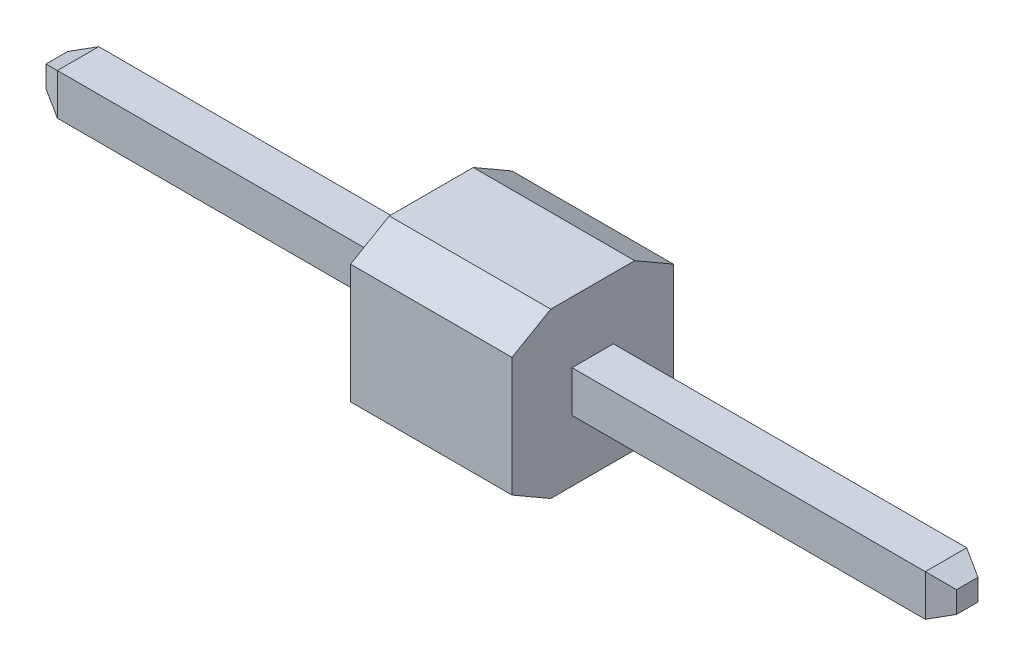
ISO-10303-21;
HEADER;
FILE_DESCRIPTION(('STEP AP214'),'2;1');
FILE_NAME('part.step','',(''),(''),'','','');
FILE_SCHEMA(('AUTOMOTIVE_DESIGN { 1 0 10303 214 1 1 1 1 }'));
ENDSEC;
DATA;
#1=APPLICATION_CONTEXT('core data for automotive mechanical design processes');
#2=APPLICATION_PROTOCOL_DEFINITION('international standard','automotive_design',2000,#1);
#3=PRODUCT_CONTEXT('',#1,'mechanical');
#4=PRODUCT('Part','Part','',(#3));
#5=PRODUCT_RELATED_PRODUCT_CATEGORY('part','',(#4));
#6=PRODUCT_DEFINITION_FORMATION('','',#4);
#7=PRODUCT_DEFINITION_CONTEXT('part definition',#1,'design');
#8=PRODUCT_DEFINITION('design','',#6,#7);
#9=PRODUCT_DEFINITION_SHAPE('','',#8);
#10=(LENGTH_UNIT() NAMED_UNIT(*) SI_UNIT(.MILLI.,.METRE.));
#11=(NAMED_UNIT(*) PLANE_ANGLE_UNIT() SI_UNIT($,.RADIAN.));
#12=(NAMED_UNIT(*) SI_UNIT($,.STERADIAN.) SOLID_ANGLE_UNIT());
#13=UNCERTAINTY_MEASURE_WITH_UNIT(LENGTH_MEASURE(1.E-05),#10,'distance_accuracy_value','');
#14=(GEOMETRIC_REPRESENTATION_CONTEXT(3) GLOBAL_UNCERTAINTY_ASSIGNED_CONTEXT((#13)) GLOBAL_UNIT_ASSIGNED_CONTEXT((#10,
#11,#12)) REPRESENTATION_CONTEXT('',''));
#15=CARTESIAN_POINT('',(0.,0.,0.));
#16=DIRECTION('',(0.,0.,1.));
#17=DIRECTION('',(1.,0.,0.));
#18=AXIS2_PLACEMENT_3D('',#15,#16,#17);
#19=CARTESIAN_POINT('',(5.42107550068064,-13.0171215871937,0.629998634255617));
#20=DIRECTION('',(1.,4.37113882867379E-08,-4.37113882867379E-08));
#21=DIRECTION('',(-4.37113882867379E-08,1.,0.));
#22=AXIS2_PLACEMENT_3D('',#19,#20,#21);
#23=PLANE('',#22);
#24=DIRECTION('',(1.59994777304463E-08,0.50000000000019,0.866025403784329));
#25=VECTOR('',#24,1.);
#26=CARTESIAN_POINT('',(5.42107537769472,-11.7735317487037,-0.940001365744382));
#27=LINE('',#26,#25);
#28=CARTESIAN_POINT('',(5.42107537769472,-11.7735317487037,-0.940001365744382));
#29=VERTEX_POINT('',#28);
#30=CARTESIAN_POINT('',(5.42107538877949,-11.4271215871937,-0.340001365744383));
#31=VERTEX_POINT('',#30);
#32=EDGE_CURVE('E11',#29,#31,#27,.T.);
#33=ORIENTED_EDGE('',*,*,#32,.T.);
#34=DIRECTION('',(4.37113880134522E-08,0.,0.999999999999999));
#35=VECTOR('',#34,1.);
#36=CARTESIAN_POINT('',(5.42107538877949,-11.4271215871937,-0.340001365744383));
#37=LINE('',#36,#35);
#38=CARTESIAN_POINT('',(5.42107544560429,-11.4271215871937,0.959998634255618));
#39=VERTEX_POINT('',#38);
#40=EDGE_CURVE('E304',#31,#39,#37,.T.);
#41=ORIENTED_EDGE('',*,*,#40,.T.);
#42=DIRECTION('',(5.97108681645512E-08,-0.500000000000186,0.86602540378433));
#43=VECTOR('',#42,1.);
#44=CARTESIAN_POINT('',(5.42107544560429,-11.4271215871937,0.959998634255618));
#45=LINE('',#44,#43);
#46=CARTESIAN_POINT('',(5.42107548697319,-11.7735317487037,1.55999863425562));
#47=VERTEX_POINT('',#46);
#48=EDGE_CURVE('E296',#39,#47,#45,.T.);
#49=ORIENTED_EDGE('',*,*,#48,.T.);
#50=DIRECTION('',(4.37113884815545E-08,-0.999999999999999,0.));
#51=VECTOR('',#50,1.);
#52=CARTESIAN_POINT('',(5.42107548697319,-11.7735317487037,1.55999863425562));
#53=LINE('',#52,#51);
#54=CARTESIAN_POINT('',(5.42107556771598,-13.6207114256737,1.55999863425562));
#55=VERTEX_POINT('',#54);
#56=EDGE_CURVE('E281',#47,#55,#53,.T.);
#57=ORIENTED_EDGE('',*,*,#56,.T.);
#58=DIRECTION('',(1.59994802942811E-08,0.500000000000195,0.866025403784326));
#59=VECTOR('',#58,1.);
#60=CARTESIAN_POINT('',(5.42107555663122,-13.9671215871937,0.959998634255618));
#61=LINE('',#60,#59);
#62=CARTESIAN_POINT('',(5.42107555663122,-13.9671215871937,0.959998634255618));
#63=VERTEX_POINT('',#62);
#64=EDGE_CURVE('E265',#63,#55,#61,.T.);
#65=ORIENTED_EDGE('',*,*,#64,.F.);
#66=DIRECTION('',(4.37113880134522E-08,0.,0.999999999999999));
#67=VECTOR('',#66,1.);
#68=CARTESIAN_POINT('',(5.42107549980641,-13.9671215871937,-0.340001365744383));
#69=LINE('',#68,#67);
#70=CARTESIAN_POINT('',(5.42107549980641,-13.9671215871937,-0.340001365744383));
#71=VERTEX_POINT('',#70);
#72=EDGE_CURVE('E248',#71,#63,#69,.T.);
#73=ORIENTED_EDGE('',*,*,#72,.F.);
#74=DIRECTION('',(5.97108656001698E-08,-0.50000000000019,0.866025403784327));
#75=VECTOR('',#74,1.);
#76=CARTESIAN_POINT('',(5.42107545843751,-13.6207114256737,-0.940001365744382));
#77=LINE('',#76,#75);
#78=CARTESIAN_POINT('',(5.42107545843751,-13.6207114256737,-0.940001365744382));
#79=VERTEX_POINT('',#78);
#80=EDGE_CURVE('E242',#79,#71,#77,.T.);
#81=ORIENTED_EDGE('',*,*,#80,.F.);
#82=DIRECTION('',(4.37113884815545E-08,-0.999999999999999,0.));
#83=VECTOR('',#82,1.);
#84=CARTESIAN_POINT('',(5.42107537769472,-11.7735317487037,-0.940001365744382));
#85=LINE('',#84,#83);
#86=EDGE_CURVE('E236',#29,#79,#85,.T.);
#87=ORIENTED_EDGE('',*,*,#86,.F.);
#88=EDGE_LOOP('',(#33,#41,#49,#57,#65,#73,#81,#87));
#89=FACE_BOUND('',#88,.T.);
#90=DIRECTION('',(-4.37113872875372E-08,0.,-0.999999999999999));
#91=VECTOR('',#90,1.);
#92=CARTESIAN_POINT('',(5.42107547270535,-12.3771215871937,0.629998634255617));
#93=LINE('',#92,#91);
#94=CARTESIAN_POINT('',(5.42107547270535,-12.3771215871937,0.629998634255617));
#95=VERTEX_POINT('',#94);
#96=CARTESIAN_POINT('',(5.42107544473006,-12.3771215871937,-0.0100013657443826));
#97=VERTEX_POINT('',#96);
#98=EDGE_CURVE('E302',#95,#97,#93,.T.);
#99=ORIENTED_EDGE('',*,*,#98,.T.);
#100=DIRECTION('',(-4.37113872875374E-08,0.999999999999999,0.));
#101=VECTOR('',#100,1.);
#102=CARTESIAN_POINT('',(5.42107547270535,-13.0171215871937,-0.0100013657443826));
#103=LINE('',#102,#101);
#104=CARTESIAN_POINT('',(5.42107547270535,-13.0171215871937,-0.0100013657443826));
#105=VERTEX_POINT('',#104);
#106=EDGE_CURVE('E293',#105,#97,#103,.T.);
#107=ORIENTED_EDGE('',*,*,#106,.F.);
#108=DIRECTION('',(-4.37113886753159E-08,0.,-0.999999999999999));
#109=VECTOR('',#108,1.);
#110=CARTESIAN_POINT('',(5.42107550068064,-13.0171215871937,0.629998634255617));
#111=LINE('',#110,#109);
#112=CARTESIAN_POINT('',(5.42107550068064,-13.0171215871937,0.629998634255617));
#113=VERTEX_POINT('',#112);
#114=EDGE_CURVE('E278',#113,#105,#111,.T.);
#115=ORIENTED_EDGE('',*,*,#114,.F.);
#116=DIRECTION('',(-4.37113886753161E-08,0.999999999999999,0.));
#117=VECTOR('',#116,1.);
#118=CARTESIAN_POINT('',(5.42107550068064,-13.0171215871937,0.629998634255617));
#119=LINE('',#118,#117);
#120=EDGE_CURVE('E263',#113,#95,#119,.T.);
#121=ORIENTED_EDGE('',*,*,#120,.T.);
#122=EDGE_LOOP('',(#99,#107,#115,#121));
#123=FACE_BOUND('',#122,.T.);
#124=ADVANCED_FACE('F17',(#89,#123),#23,.T.);
#125=CARTESIAN_POINT('',(2.92107550068064,-13.0171216964722,0.629998743534088));
#126=DIRECTION('',(1.,4.37113882867379E-08,-4.37113882867379E-08));
#127=DIRECTION('',(-4.37113882867379E-08,1.,0.));
#128=AXIS2_PLACEMENT_3D('',#125,#126,#127);
#129=PLANE('',#128);
#130=DIRECTION('',(1.59994790124215E-08,0.50000000000019,0.866025403784329));
#131=VECTOR('',#130,1.);
#132=CARTESIAN_POINT('',(2.92107537769472,-11.7735318579822,-0.940001256465912));
#133=LINE('',#132,#131);
#134=CARTESIAN_POINT('',(2.92107537769472,-11.7735318579822,-0.940001256465912));
#135=VERTEX_POINT('',#134);
#136=CARTESIAN_POINT('',(2.92107538877949,-11.4271216964722,-0.340001256465912));
#137=VERTEX_POINT('',#136);
#138=EDGE_CURVE('E24',#135,#137,#133,.T.);
#139=ORIENTED_EDGE('',*,*,#138,.F.);
#140=DIRECTION('',(4.37113884815545E-08,-0.999999999999999,0.));
#141=VECTOR('',#140,1.);
#142=CARTESIAN_POINT('',(2.92107537769472,-11.7735318579822,-0.940001256465912));
#143=LINE('',#142,#141);
#144=CARTESIAN_POINT('',(2.92107545843751,-13.6207115349522,-0.940001256465912));
#145=VERTEX_POINT('',#144);
#146=EDGE_CURVE('E300',#135,#145,#143,.T.);
#147=ORIENTED_EDGE('',*,*,#146,.T.);
#148=DIRECTION('',(5.97108662411574E-08,-0.50000000000019,0.866025403784327));
#149=VECTOR('',#148,1.);
#150=CARTESIAN_POINT('',(2.92107545843751,-13.6207115349522,-0.940001256465912));
#151=LINE('',#150,#149);
#152=CARTESIAN_POINT('',(2.92107549980641,-13.9671216964722,-0.340001256465912));
#153=VERTEX_POINT('',#152);
#154=EDGE_CURVE('E286',#145,#153,#151,.T.);
#155=ORIENTED_EDGE('',*,*,#154,.T.);
#156=DIRECTION('',(4.37113883550593E-08,0.,0.999999999999999));
#157=VECTOR('',#156,1.);
#158=CARTESIAN_POINT('',(2.92107549980641,-13.9671216964722,-0.340001256465912));
#159=LINE('',#158,#157);
#160=CARTESIAN_POINT('',(2.92107555663122,-13.9671216964722,0.959998743534088));
#161=VERTEX_POINT('',#160);
#162=EDGE_CURVE('E271',#153,#161,#159,.T.);
#163=ORIENTED_EDGE('',*,*,#162,.T.);
#164=DIRECTION('',(1.59994790123059E-08,0.500000000000195,0.866025403784326));
#165=VECTOR('',#164,1.);
#166=CARTESIAN_POINT('',(2.92107555663122,-13.9671216964722,0.959998743534088));
#167=LINE('',#166,#165);
#168=CARTESIAN_POINT('',(2.92107556771598,-13.6207115349522,1.55999874353409));
#169=VERTEX_POINT('',#168);
#170=EDGE_CURVE('E253',#161,#169,#167,.T.);
#171=ORIENTED_EDGE('',*,*,#170,.T.);
#172=DIRECTION('',(4.37113884815545E-08,-0.999999999999999,0.));
#173=VECTOR('',#172,1.);
#174=CARTESIAN_POINT('',(2.92107548697319,-11.7735318579822,1.55999874353409));
#175=LINE('',#174,#173);
#176=CARTESIAN_POINT('',(2.92107548697319,-11.7735318579822,1.55999874353409));
#177=VERTEX_POINT('',#176);
#178=EDGE_CURVE('E261',#177,#169,#175,.T.);
#179=ORIENTED_EDGE('',*,*,#178,.F.);
#180=DIRECTION('',(5.97108668825761E-08,-0.500000000000186,0.86602540378433));
#181=VECTOR('',#180,1.);
#182=CARTESIAN_POINT('',(2.92107544560429,-11.4271216964722,0.959998743534088));
#183=LINE('',#182,#181);
#184=CARTESIAN_POINT('',(2.92107544560429,-11.4271216964722,0.959998743534088));
#185=VERTEX_POINT('',#184);
#186=EDGE_CURVE('E276',#185,#177,#183,.T.);
#187=ORIENTED_EDGE('',*,*,#186,.F.);
#188=DIRECTION('',(4.37113880134522E-08,0.,0.999999999999999));
#189=VECTOR('',#188,1.);
#190=CARTESIAN_POINT('',(2.92107538877949,-11.4271216964722,-0.340001256465912));
#191=LINE('',#190,#189);
#192=EDGE_CURVE('E291',#137,#185,#191,.T.);
#193=ORIENTED_EDGE('',*,*,#192,.F.);
#194=EDGE_LOOP('',(#139,#147,#155,#163,#171,#179,#187,#193));
#195=FACE_BOUND('',#194,.T.);
#196=DIRECTION('',(-4.37113879814267E-08,0.999999999999999,0.));
#197=VECTOR('',#196,1.);
#198=CARTESIAN_POINT('',(2.92107547270535,-13.0171216964722,-0.0100012564659119));
#199=LINE('',#198,#197);
#200=CARTESIAN_POINT('',(2.92107547270535,-13.0171216964722,-0.0100012564659119));
#201=VERTEX_POINT('',#200);
#202=CARTESIAN_POINT('',(2.92107544473006,-12.3771216964722,-0.0100012564659119));
#203=VERTEX_POINT('',#202);
#204=EDGE_CURVE('E298',#201,#203,#199,.T.);
#205=ORIENTED_EDGE('',*,*,#204,.T.);
#206=DIRECTION('',(-4.37113879814266E-08,0.,-0.999999999999999));
#207=VECTOR('',#206,1.);
#208=CARTESIAN_POINT('',(2.92107547270535,-12.3771216964722,0.629998743534088));
#209=LINE('',#208,#207);
#210=CARTESIAN_POINT('',(2.92107547270535,-12.3771216964722,0.629998743534088));
#211=VERTEX_POINT('',#210);
#212=EDGE_CURVE('E283',#211,#203,#209,.T.);
#213=ORIENTED_EDGE('',*,*,#212,.F.);
#214=DIRECTION('',(-4.37113879814267E-08,0.999999999999999,0.));
#215=VECTOR('',#214,1.);
#216=CARTESIAN_POINT('',(2.92107550068064,-13.0171216964722,0.629998743534088));
#217=LINE('',#216,#215);
#218=CARTESIAN_POINT('',(2.92107550068064,-13.0171216964722,0.629998743534088));
#219=VERTEX_POINT('',#218);
#220=EDGE_CURVE('E268',#219,#211,#217,.T.);
#221=ORIENTED_EDGE('',*,*,#220,.F.);
#222=DIRECTION('',(-4.37113879814266E-08,0.,-0.999999999999999));
#223=VECTOR('',#222,1.);
#224=CARTESIAN_POINT('',(2.92107550068064,-13.0171216964722,0.629998743534088));
#225=LINE('',#224,#223);
#226=EDGE_CURVE('E251',#219,#201,#225,.T.);
#227=ORIENTED_EDGE('',*,*,#226,.T.);
#228=EDGE_LOOP('',(#205,#213,#221,#227));
#229=FACE_BOUND('',#228,.T.);
#230=ADVANCED_FACE('F314',(#195,#229),#129,.F.);
#231=CARTESIAN_POINT('',(5.42107537769472,-11.7735317487037,-0.940001365744382));
#232=DIRECTION('',(5.97108668343731E-08,-0.866025403784328,0.50000000000019));
#233=DIRECTION('',(-1.59994785476185E-08,-0.500000000000192,-0.866025403784329));
#234=AXIS2_PLACEMENT_3D('',#231,#232,#233);
#235=PLANE('',#234);
#236=ORIENTED_EDGE('',*,*,#138,.T.);
#237=DIRECTION('',(-0.999999999999998,-4.37113897078233E-08,4.37113883755557E-08));
#238=VECTOR('',#237,1.);
#239=CARTESIAN_POINT('',(5.42107538877949,-11.4271215871937,-0.340001365744383));
#240=LINE('',#239,#238);
#241=EDGE_CURVE('E288',#31,#137,#240,.T.);
#242=ORIENTED_EDGE('',*,*,#241,.F.);
#243=ORIENTED_EDGE('',*,*,#32,.F.);
#244=DIRECTION('',(-0.999999999999998,-4.37113868656524E-08,4.37113881091021E-08));
#245=VECTOR('',#244,1.);
#246=CARTESIAN_POINT('',(5.42107537769472,-11.7735317487037,-0.940001365744382));
#247=LINE('',#246,#245);
#248=EDGE_CURVE('E256',#29,#135,#247,.T.);
#249=ORIENTED_EDGE('',*,*,#248,.T.);
#250=EDGE_LOOP('',(#236,#242,#243,#249));
#251=FACE_BOUND('',#250,.T.);
#252=ADVANCED_FACE('F306',(#251),#235,.F.);
#253=CARTESIAN_POINT('',(5.42107538877949,-11.4271215871937,-0.340001365744383));
#254=DIRECTION('',(4.37113882867379E-08,-1.,0.));
#255=DIRECTION('',(1.,4.37113882867379E-08,-4.37113882867379E-08));
#256=AXIS2_PLACEMENT_3D('',#253,#254,#255);
#257=PLANE('',#256);
#258=ORIENTED_EDGE('',*,*,#192,.T.);
#259=DIRECTION('',(-0.999999999999998,-4.37113897078233E-08,4.37113882867378E-08));
#260=VECTOR('',#259,1.);
#261=CARTESIAN_POINT('',(5.42107544560429,-11.4271215871937,0.959998634255618));
#262=LINE('',#261,#260);
#263=EDGE_CURVE('E273',#39,#185,#262,.T.);
#264=ORIENTED_EDGE('',*,*,#263,.F.);
#265=ORIENTED_EDGE('',*,*,#40,.F.);
#266=ORIENTED_EDGE('',*,*,#241,.T.);
#267=EDGE_LOOP('',(#258,#264,#265,#266));
#268=FACE_BOUND('',#267,.T.);
#269=ADVANCED_FACE('F311',(#268),#257,.F.);
#270=CARTESIAN_POINT('',(5.42107544560429,-11.4271215871937,0.959998634255618));
#271=DIRECTION('',(1.59994785476185E-08,-0.86602540378433,-0.50000000000019));
#272=DIRECTION('',(-5.97108668343731E-08,0.500000000000188,-0.866025403784329));
#273=AXIS2_PLACEMENT_3D('',#270,#271,#272);
#274=PLANE('',#273);
#275=ORIENTED_EDGE('',*,*,#186,.T.);
#276=DIRECTION('',(-0.999999999999998,-4.37113868656524E-08,4.37113882867378E-08));
#277=VECTOR('',#276,1.);
#278=CARTESIAN_POINT('',(5.42107548697319,-11.7735317487037,1.55999863425562));
#279=LINE('',#278,#277);
#280=EDGE_CURVE('E258',#47,#177,#279,.T.);
#281=ORIENTED_EDGE('',*,*,#280,.F.);
#282=ORIENTED_EDGE('',*,*,#48,.F.);
#283=ORIENTED_EDGE('',*,*,#263,.T.);
#284=EDGE_LOOP('',(#275,#281,#282,#283));
#285=FACE_BOUND('',#284,.T.);
#286=ADVANCED_FACE('F319',(#285),#274,.F.);
#287=CARTESIAN_POINT('',(5.42107548697319,-11.7735317487037,1.55999863425562));
#288=DIRECTION('',(-4.37113882867379E-08,0.,-1.));
#289=DIRECTION('',(-1.,-4.37113882867379E-08,4.37113882867379E-08));
#290=AXIS2_PLACEMENT_3D('',#287,#288,#289);
#291=PLANE('',#290);
#292=ORIENTED_EDGE('',*,*,#178,.T.);
#293=DIRECTION('',(-0.999999999999998,-4.37113897078233E-08,4.37113882867378E-08));
#294=VECTOR('',#293,1.);
#295=CARTESIAN_POINT('',(5.42107556771598,-13.6207114256737,1.55999863425562));
#296=LINE('',#295,#294);
#297=EDGE_CURVE('E245',#55,#169,#296,.T.);
#298=ORIENTED_EDGE('',*,*,#297,.F.);
#299=ORIENTED_EDGE('',*,*,#56,.F.);
#300=ORIENTED_EDGE('',*,*,#280,.T.);
#301=EDGE_LOOP('',(#292,#298,#299,#300));
#302=FACE_BOUND('',#301,.T.);
#303=ADVANCED_FACE('F326',(#302),#291,.F.);
#304=CARTESIAN_POINT('',(5.42107555663122,-13.9671215871937,0.959998634255618));
#305=DIRECTION('',(5.97108668343731E-08,-0.866025403784328,0.50000000000019));
#306=DIRECTION('',(-1.59994785476185E-08,-0.500000000000192,-0.866025403784329));
#307=AXIS2_PLACEMENT_3D('',#304,#305,#306);
#308=PLANE('',#307);
#309=ORIENTED_EDGE('',*,*,#170,.F.);
#310=DIRECTION('',(-0.999999999999998,-4.37113854445669E-08,4.37113882867378E-08));
#311=VECTOR('',#310,1.);
#312=CARTESIAN_POINT('',(5.42107555663122,-13.9671215871937,0.959998634255618));
#313=LINE('',#312,#311);
#314=EDGE_CURVE('E239',#63,#161,#313,.T.);
#315=ORIENTED_EDGE('',*,*,#314,.F.);
#316=ORIENTED_EDGE('',*,*,#64,.T.);
#317=ORIENTED_EDGE('',*,*,#297,.T.);
#318=EDGE_LOOP('',(#309,#315,#316,#317));
#319=FACE_BOUND('',#318,.T.);
#320=ADVANCED_FACE('F329',(#319),#308,.T.);
#321=CARTESIAN_POINT('',(5.42107549980641,-13.9671215871937,-0.340001365744383));
#322=DIRECTION('',(4.37113882867379E-08,-1.,0.));
#323=DIRECTION('',(1.,4.37113882867379E-08,-4.37113882867379E-08));
#324=AXIS2_PLACEMENT_3D('',#321,#322,#323);
#325=PLANE('',#324);
#326=ORIENTED_EDGE('',*,*,#162,.F.);
#327=DIRECTION('',(-0.999999999999998,-4.37113854445669E-08,4.37113883755557E-08));
#328=VECTOR('',#327,1.);
#329=CARTESIAN_POINT('',(5.42107549980641,-13.9671215871937,-0.340001365744383));
#330=LINE('',#329,#328);
#331=EDGE_CURVE('E233',#71,#153,#330,.T.);
#332=ORIENTED_EDGE('',*,*,#331,.F.);
#333=ORIENTED_EDGE('',*,*,#72,.T.);
#334=ORIENTED_EDGE('',*,*,#314,.T.);
#335=EDGE_LOOP('',(#326,#332,#333,#334));
#336=FACE_BOUND('',#335,.T.);
#337=ADVANCED_FACE('F333',(#336),#325,.T.);
#338=CARTESIAN_POINT('',(5.42107545843751,-13.6207114256737,-0.940001365744382));
#339=DIRECTION('',(1.59994785476185E-08,-0.86602540378433,-0.50000000000019));
#340=DIRECTION('',(-5.97108668343731E-08,0.500000000000188,-0.866025403784329));
#341=AXIS2_PLACEMENT_3D('',#338,#339,#340);
#342=PLANE('',#341);
#343=ORIENTED_EDGE('',*,*,#154,.F.);
#344=DIRECTION('',(-0.999999999999998,-4.37113897078233E-08,4.37113881091021E-08));
#345=VECTOR('',#344,1.);
#346=CARTESIAN_POINT('',(5.42107545843751,-13.6207114256737,-0.940001365744382));
#347=LINE('',#346,#345);
#348=EDGE_CURVE('E230',#79,#145,#347,.T.);
#349=ORIENTED_EDGE('',*,*,#348,.F.);
#350=ORIENTED_EDGE('',*,*,#80,.T.);
#351=ORIENTED_EDGE('',*,*,#331,.T.);
#352=EDGE_LOOP('',(#343,#349,#350,#351));
#353=FACE_BOUND('',#352,.T.);
#354=ADVANCED_FACE('F337',(#353),#342,.T.);
#355=CARTESIAN_POINT('',(5.42107537769472,-11.7735317487037,-0.940001365744382));
#356=DIRECTION('',(-4.37113882867379E-08,0.,-1.));
#357=DIRECTION('',(-4.37113882867379E-08,1.,0.));
#358=AXIS2_PLACEMENT_3D('',#355,#356,#357);
#359=PLANE('',#358);
#360=ORIENTED_EDGE('',*,*,#146,.F.);
#361=ORIENTED_EDGE('',*,*,#248,.F.);
#362=ORIENTED_EDGE('',*,*,#86,.T.);
#363=ORIENTED_EDGE('',*,*,#348,.T.);
#364=EDGE_LOOP('',(#360,#361,#362,#363));
#365=FACE_BOUND('',#364,.T.);
#366=ADVANCED_FACE('F339',(#365),#359,.T.);
#367=CARTESIAN_POINT('',(-2.87892449931936,-13.0171219499982,0.62999899706014));
#368=DIRECTION('',(-1.,-4.37113882867379E-08,4.37113882867379E-08));
#369=DIRECTION('',(4.37113882867379E-08,-1.,0.));
#370=AXIS2_PLACEMENT_3D('',#367,#368,#369);
#371=PLANE('',#370);
#372=DIRECTION('',(4.37113900757526E-08,-0.999999999999999,0.));
#373=VECTOR('',#372,1.);
#374=CARTESIAN_POINT('',(-2.87892454181719,-12.5310034771882,0.14388052425114));
#375=LINE('',#374,#373);
#376=CARTESIAN_POINT('',(-2.87892454181719,-12.5310034771882,0.14388052425114));
#377=VERTEX_POINT('',#376);
#378=CARTESIAN_POINT('',(-2.87892452729465,-12.8632404227982,0.14388052425114));
#379=VERTEX_POINT('',#378);
#380=EDGE_CURVE('E228',#377,#379,#375,.T.);
#381=ORIENTED_EDGE('',*,*,#380,.T.);
#382=DIRECTION('',(4.37113900746999E-08,0.,0.999999999999999));
#383=VECTOR('',#382,1.);
#384=CARTESIAN_POINT('',(-2.87892452729465,-12.8632404227982,0.14388052425114));
#385=LINE('',#384,#383);
#386=CARTESIAN_POINT('',(-2.87892451277211,-12.8632404227982,0.47611746986914));
#387=VERTEX_POINT('',#386);
#388=EDGE_CURVE('E223',#379,#387,#385,.T.);
#389=ORIENTED_EDGE('',*,*,#388,.T.);
#390=DIRECTION('',(-4.37113874024243E-08,0.999999999999999,0.));
#391=VECTOR('',#390,1.);
#392=CARTESIAN_POINT('',(-2.87892451277211,-12.8632404227982,0.47611746986914));
#393=LINE('',#392,#391);
#394=CARTESIAN_POINT('',(-2.87892452729465,-12.5310034771882,0.47611746986914));
#395=VERTEX_POINT('',#394);
#396=EDGE_CURVE('E215',#387,#395,#393,.T.);
#397=ORIENTED_EDGE('',*,*,#396,.T.);
#398=DIRECTION('',(-4.37113820547151E-08,0.,-0.999999999999999));
#399=VECTOR('',#398,1.);
#400=CARTESIAN_POINT('',(-2.87892452729465,-12.5310034771882,0.47611746986914));
#401=LINE('',#400,#399);
#402=EDGE_CURVE('E207',#395,#377,#401,.T.);
#403=ORIENTED_EDGE('',*,*,#402,.T.);
#404=EDGE_LOOP('',(#381,#389,#397,#403));
#405=FACE_BOUND('',#404,.T.);
#406=ADVANCED_FACE('F341',(#405),#371,.T.);
#407=CARTESIAN_POINT('',(-2.87892449931936,-13.0171219499982,0.62999899706014));
#408=DIRECTION('',(4.37113882867379E-08,-1.,0.));
#409=DIRECTION('',(-4.37113882867379E-08,0.,-1.));
#410=AXIS2_PLACEMENT_3D('',#407,#408,#409);
#411=PLANE('',#410);
#412=DIRECTION('',(0.999999999999998,4.37113868968279E-08,-4.37113882769955E-08));
#413=VECTOR('',#412,1.);
#414=CARTESIAN_POINT('',(-2.54892449931936,-13.0171219355735,0.629998982635382));
#415=LINE('',#414,#413);
#416=CARTESIAN_POINT('',(-2.54892449931936,-13.0171219355735,0.629998982635382));
#417=VERTEX_POINT('',#416);
#418=EDGE_CURVE('E225',#417,#219,#415,.T.);
#419=ORIENTED_EDGE('',*,*,#418,.F.);
#420=DIRECTION('',(-4.37113886753159E-08,0.,-0.999999999999999));
#421=VECTOR('',#420,1.);
#422=CARTESIAN_POINT('',(-2.54892449931936,-13.0171219355735,0.629998982635382));
#423=LINE('',#422,#421);
#424=CARTESIAN_POINT('',(-2.54892452729465,-13.0171219355735,-0.010001017364618));
#425=VERTEX_POINT('',#424);
#426=EDGE_CURVE('E217',#417,#425,#423,.T.);
#427=ORIENTED_EDGE('',*,*,#426,.T.);
#428=DIRECTION('',(0.999999999999998,4.37113868968279E-08,-4.37113882161057E-08));
#429=VECTOR('',#428,1.);
#430=CARTESIAN_POINT('',(-2.54892452729465,-13.0171219355735,-0.010001017364618));
#431=LINE('',#430,#429);
#432=EDGE_CURVE('E220',#425,#201,#431,.T.);
#433=ORIENTED_EDGE('',*,*,#432,.T.);
#434=ORIENTED_EDGE('',*,*,#226,.F.);
#435=EDGE_LOOP('',(#419,#427,#433,#434));
#436=FACE_BOUND('',#435,.T.);
#437=ADVANCED_FACE('F348',(#436),#411,.T.);
#438=CARTESIAN_POINT('',(-2.87892452729465,-13.0171219499982,-0.0100010029398598));
#439=DIRECTION('',(-4.37113882867379E-08,0.,-1.));
#440=DIRECTION('',(-1.,-4.37113882867379E-08,4.37113882867379E-08));
#441=AXIS2_PLACEMENT_3D('',#438,#439,#440);
#442=PLANE('',#441);
#443=ORIENTED_EDGE('',*,*,#432,.F.);
#444=DIRECTION('',(-4.37113872875374E-08,0.999999999999999,0.));
#445=VECTOR('',#444,1.);
#446=CARTESIAN_POINT('',(-2.54892452729465,-13.0171219355735,-0.010001017364618));
#447=LINE('',#446,#445);
#448=CARTESIAN_POINT('',(-2.54892455526994,-12.3771219355735,-0.010001017364618));
#449=VERTEX_POINT('',#448);
#450=EDGE_CURVE('E209',#425,#449,#447,.T.);
#451=ORIENTED_EDGE('',*,*,#450,.T.);
#452=DIRECTION('',(0.999999999999998,4.37113868968279E-08,-4.37113882161057E-08));
#453=VECTOR('',#452,1.);
#454=CARTESIAN_POINT('',(-2.54892455526994,-12.3771219355735,-0.010001017364618));
#455=LINE('',#454,#453);
#456=EDGE_CURVE('E212',#449,#203,#455,.T.);
#457=ORIENTED_EDGE('',*,*,#456,.T.);
#458=ORIENTED_EDGE('',*,*,#204,.F.);
#459=EDGE_LOOP('',(#443,#451,#457,#458));
#460=FACE_BOUND('',#459,.T.);
#461=ADVANCED_FACE('F424',(#460),#442,.T.);
#462=CARTESIAN_POINT('',(-2.87892452729465,-12.3771219499982,0.62999899706014));
#463=DIRECTION('',(4.37113882867379E-08,-1.,0.));
#464=DIRECTION('',(-4.37113882867379E-08,0.,-1.));
#465=AXIS2_PLACEMENT_3D('',#462,#463,#464);
#466=PLANE('',#465);
#467=ORIENTED_EDGE('',*,*,#456,.F.);
#468=DIRECTION('',(4.37113886753159E-08,0.,0.999999999999999));
#469=VECTOR('',#468,1.);
#470=CARTESIAN_POINT('',(-2.54892455526994,-12.3771219355735,-0.010001017364618));
#471=LINE('',#470,#469);
#472=CARTESIAN_POINT('',(-2.54892452729465,-12.3771219355735,0.629998982635382));
#473=VERTEX_POINT('',#472);
#474=EDGE_CURVE('E201',#449,#473,#471,.T.);
#475=ORIENTED_EDGE('',*,*,#474,.T.);
#476=DIRECTION('',(0.999999999999998,4.37113868968279E-08,-4.37113882769955E-08));
#477=VECTOR('',#476,1.);
#478=CARTESIAN_POINT('',(-2.54892452729465,-12.3771219355735,0.629998982635382));
#479=LINE('',#478,#477);
#480=EDGE_CURVE('E204',#473,#211,#479,.T.);
#481=ORIENTED_EDGE('',*,*,#480,.T.);
#482=ORIENTED_EDGE('',*,*,#212,.T.);
#483=EDGE_LOOP('',(#467,#475,#481,#482));
#484=FACE_BOUND('',#483,.T.);
#485=ADVANCED_FACE('F421',(#484),#466,.F.);
#486=CARTESIAN_POINT('',(-2.87892449931936,-13.0171219499982,0.62999899706014));
#487=DIRECTION('',(-4.37113882867379E-08,0.,-1.));
#488=DIRECTION('',(-1.,-4.37113882867379E-08,4.37113882867379E-08));
#489=AXIS2_PLACEMENT_3D('',#486,#487,#488);
#490=PLANE('',#489);
#491=ORIENTED_EDGE('',*,*,#480,.F.);
#492=DIRECTION('',(4.37113872875374E-08,-0.999999999999999,0.));
#493=VECTOR('',#492,1.);
#494=CARTESIAN_POINT('',(-2.54892452729465,-12.3771219355735,0.629998982635382));
#495=LINE('',#494,#493);
#496=EDGE_CURVE('E196',#473,#417,#495,.T.);
#497=ORIENTED_EDGE('',*,*,#496,.T.);
#498=ORIENTED_EDGE('',*,*,#418,.T.);
#499=ORIENTED_EDGE('',*,*,#220,.T.);
#500=EDGE_LOOP('',(#491,#497,#498,#499));
#501=FACE_BOUND('',#500,.T.);
#502=ADVANCED_FACE('F376',(#501),#490,.F.);
#503=CARTESIAN_POINT('',(-2.87892449931936,-13.0171219499982,0.62999899706014));
#504=DIRECTION('',(-4.37113882867379E-08,0.,-1.));
#505=DIRECTION('',(-1.,-4.37113882867379E-08,4.37113882867379E-08));
#506=AXIS2_PLACEMENT_3D('',#503,#504,#505);
#507=PLANE('',#506);
#508=DIRECTION('',(0.999999999999998,4.37113778039593E-08,-4.37113882769955E-08));
#509=VECTOR('',#508,1.);
#510=CARTESIAN_POINT('',(5.42107550068064,-13.0171215871937,0.629998634255617));
#511=LINE('',#510,#509);
#512=CARTESIAN_POINT('',(10.8910755006806,-13.0171213480924,0.629998395154324));
#513=VERTEX_POINT('',#512);
#514=EDGE_CURVE('E199',#113,#513,#511,.T.);
#515=ORIENTED_EDGE('',*,*,#514,.T.);
#516=DIRECTION('',(-4.37113872875374E-08,0.999999999999999,0.));
#517=VECTOR('',#516,1.);
#518=CARTESIAN_POINT('',(10.8910755006806,-13.0171213480924,0.629998395154324));
#519=LINE('',#518,#517);
#520=CARTESIAN_POINT('',(10.8910754727053,-12.3771213480924,0.629998395154324));
#521=VERTEX_POINT('',#520);
#522=EDGE_CURVE('E191',#513,#521,#519,.T.);
#523=ORIENTED_EDGE('',*,*,#522,.T.);
#524=DIRECTION('',(0.999999999999998,4.37113933917341E-08,-4.37113882769955E-08));
#525=VECTOR('',#524,1.);
#526=CARTESIAN_POINT('',(5.42107547270535,-12.3771215871937,0.629998634255617));
#527=LINE('',#526,#525);
#528=EDGE_CURVE('E194',#95,#521,#527,.T.);
#529=ORIENTED_EDGE('',*,*,#528,.F.);
#530=ORIENTED_EDGE('',*,*,#120,.F.);
#531=EDGE_LOOP('',(#515,#523,#529,#530));
#532=FACE_BOUND('',#531,.T.);
#533=ADVANCED_FACE('F367',(#532),#507,.F.);
#534=CARTESIAN_POINT('',(-2.87892452729465,-12.3771219499982,0.62999899706014));
#535=DIRECTION('',(4.37113882867379E-08,-1.,0.));
#536=DIRECTION('',(-4.37113882867379E-08,0.,-1.));
#537=AXIS2_PLACEMENT_3D('',#534,#535,#536);
#538=PLANE('',#537);
#539=ORIENTED_EDGE('',*,*,#528,.T.);
#540=DIRECTION('',(-4.37113872875372E-08,0.,-0.999999999999999));
#541=VECTOR('',#540,1.);
#542=CARTESIAN_POINT('',(10.8910754727053,-12.3771213480924,0.629998395154324));
#543=LINE('',#542,#541);
#544=CARTESIAN_POINT('',(10.8910754447301,-12.3771213480924,-0.0100016048456765));
#545=VERTEX_POINT('',#544);
#546=EDGE_CURVE('E186',#521,#545,#543,.T.);
#547=ORIENTED_EDGE('',*,*,#546,.T.);
#548=DIRECTION('',(0.999999999999998,4.37113933917341E-08,-4.37113881146228E-08));
#549=VECTOR('',#548,1.);
#550=CARTESIAN_POINT('',(5.42107544473006,-12.3771215871937,-0.0100013657443823));
#551=LINE('',#550,#549);
#552=EDGE_CURVE('E189',#97,#545,#551,.T.);
#553=ORIENTED_EDGE('',*,*,#552,.F.);
#554=ORIENTED_EDGE('',*,*,#98,.F.);
#555=EDGE_LOOP('',(#539,#547,#553,#554));
#556=FACE_BOUND('',#555,.T.);
#557=ADVANCED_FACE('F364',(#556),#538,.F.);
#558=CARTESIAN_POINT('',(-2.87892452729465,-13.0171219499982,-0.0100010029398598));
#559=DIRECTION('',(-4.37113882867379E-08,0.,-1.));
#560=DIRECTION('',(-1.,-4.37113882867379E-08,4.37113882867379E-08));
#561=AXIS2_PLACEMENT_3D('',#558,#559,#560);
#562=PLANE('',#561);
#563=ORIENTED_EDGE('',*,*,#552,.T.);
#564=DIRECTION('',(4.37113872875374E-08,-0.999999999999999,0.));
#565=VECTOR('',#564,1.);
#566=CARTESIAN_POINT('',(10.8910754447301,-12.3771213480924,-0.0100016048456765));
#567=LINE('',#566,#565);
#568=CARTESIAN_POINT('',(10.8910754727053,-13.0171213480924,-0.0100016048456765));
#569=VERTEX_POINT('',#568);
#570=EDGE_CURVE('E176',#545,#569,#567,.T.);
#571=ORIENTED_EDGE('',*,*,#570,.T.);
#572=DIRECTION('',(0.999999999999998,4.37113778039593E-08,-4.37113881146228E-08));
#573=VECTOR('',#572,1.);
#574=CARTESIAN_POINT('',(5.42107547270535,-13.0171215871937,-0.0100013657443823));
#575=LINE('',#574,#573);
#576=EDGE_CURVE('E179',#105,#569,#575,.T.);
#577=ORIENTED_EDGE('',*,*,#576,.F.);
#578=ORIENTED_EDGE('',*,*,#106,.T.);
#579=EDGE_LOOP('',(#563,#571,#577,#578));
#580=FACE_BOUND('',#579,.T.);
#581=ADVANCED_FACE('F366',(#580),#562,.T.);
#582=CARTESIAN_POINT('',(-2.87892449931936,-13.0171219499982,0.62999899706014));
#583=DIRECTION('',(4.37113882867379E-08,-1.,0.));
#584=DIRECTION('',(-4.37113882867379E-08,0.,-1.));
#585=AXIS2_PLACEMENT_3D('',#582,#583,#584);
#586=PLANE('',#585);
#587=ORIENTED_EDGE('',*,*,#576,.T.);
#588=DIRECTION('',(4.37113872875372E-08,0.,0.999999999999999));
#589=VECTOR('',#588,1.);
#590=CARTESIAN_POINT('',(10.8910754727054,-13.0171213480924,-0.0100016048456765));
#591=LINE('',#590,#589);
#592=EDGE_CURVE('E167',#569,#513,#591,.T.);
#593=ORIENTED_EDGE('',*,*,#592,.T.);
#594=ORIENTED_EDGE('',*,*,#514,.F.);
#595=ORIENTED_EDGE('',*,*,#114,.T.);
#596=EDGE_LOOP('',(#587,#593,#594,#595));
#597=FACE_BOUND('',#596,.T.);
#598=ADVANCED_FACE('F373',(#597),#586,.T.);
#599=CARTESIAN_POINT('',(11.2210755006806,-13.0171213336676,0.629998380729565));
#600=DIRECTION('',(-1.,-4.37113882867379E-08,4.37113882867379E-08));
#601=DIRECTION('',(4.37113882867379E-08,-1.,0.));
#602=AXIS2_PLACEMENT_3D('',#599,#600,#601);
#603=PLANE('',#602);
#604=DIRECTION('',(-4.37113874024243E-08,0.999999999999999,0.));
#605=VECTOR('',#604,1.);
#606=CARTESIAN_POINT('',(11.2210754727054,-12.8632398064676,0.143879907920565));
#607=LINE('',#606,#605);
#608=CARTESIAN_POINT('',(11.2210754727054,-12.8632398064676,0.143879907920565));
#609=VERTEX_POINT('',#608);
#610=CARTESIAN_POINT('',(11.2210754581828,-12.5310028608576,0.143879907920565));
#611=VERTEX_POINT('',#610);
#612=EDGE_CURVE('E153',#609,#611,#607,.T.);
#613=ORIENTED_EDGE('',*,*,#612,.T.);
#614=DIRECTION('',(4.37113874013716E-08,0.,0.999999999999999));
#615=VECTOR('',#614,1.);
#616=CARTESIAN_POINT('',(11.2210754581828,-12.5310028608577,0.143879907920565));
#617=LINE('',#616,#615);
#618=CARTESIAN_POINT('',(11.2210754727054,-12.5310028608576,0.476116853538565));
#619=VERTEX_POINT('',#618);
#620=EDGE_CURVE('E395',#611,#619,#617,.T.);
#621=ORIENTED_EDGE('',*,*,#620,.T.);
#622=DIRECTION('',(4.37113874024243E-08,-0.999999999999999,0.));
#623=VECTOR('',#622,1.);
#624=CARTESIAN_POINT('',(11.2210754727054,-12.5310028608576,0.476116853538565));
#625=LINE('',#624,#623);
#626=CARTESIAN_POINT('',(11.2210754872279,-12.8632398064676,0.476116853538565));
#627=VERTEX_POINT('',#626);
#628=EDGE_CURVE('E156',#619,#627,#625,.T.);
#629=ORIENTED_EDGE('',*,*,#628,.T.);
#630=DIRECTION('',(-4.37113927480282E-08,0.,-0.999999999999999));
#631=VECTOR('',#630,1.);
#632=CARTESIAN_POINT('',(11.2210754872279,-12.8632398064676,0.476116853538565));
#633=LINE('',#632,#631);
#634=EDGE_CURVE('E149',#627,#609,#633,.T.);
#635=ORIENTED_EDGE('',*,*,#634,.T.);
#636=EDGE_LOOP('',(#613,#621,#629,#635));
#637=FACE_BOUND('',#636,.T.);
#638=ADVANCED_FACE('F151',(#637),#603,.F.);
#639=CARTESIAN_POINT('',(-2.87892452056827,-12.5310034771882,0.62999899706014));
#640=DIRECTION('',(-0.422618301356784,0.906307768563367,1.84732310895534E-08));
#641=DIRECTION('',(4.37113882867379E-08,0.,1.));
#642=AXIS2_PLACEMENT_3D('',#639,#640,#641);
#643=PLANE('',#642);
#644=DIRECTION('',(0.834817095446925,0.389281657126021,-0.389281657126018));
#645=VECTOR('',#644,1.);
#646=CARTESIAN_POINT('',(-2.8789245418172,-12.5310034771877,0.143880524251623));
#647=LINE('',#646,#645);
#648=EDGE_CURVE('E181',#377,#449,#647,.T.);
#649=ORIENTED_EDGE('',*,*,#648,.F.);
#650=ORIENTED_EDGE('',*,*,#402,.F.);
#651=DIRECTION('',(-0.834817129479003,-0.389281657126029,-0.389281584143985));
#652=VECTOR('',#651,1.);
#653=CARTESIAN_POINT('',(-2.54892452729508,-12.377121935572,0.629998982634844));
#654=LINE('',#653,#652);
#655=EDGE_CURVE('E404',#473,#395,#654,.T.);
#656=ORIENTED_EDGE('',*,*,#655,.F.);
#657=ORIENTED_EDGE('',*,*,#474,.F.);
#658=EDGE_LOOP('',(#649,#650,#656,#657));
#659=FACE_BOUND('',#658,.T.);
#660=ADVANCED_FACE('F418',(#659),#643,.T.);
#661=CARTESIAN_POINT('',(-2.87892450604574,-13.0171219499982,0.47611746986914));
#662=DIRECTION('',(-0.422618222124841,-1.84732292043498E-08,0.906307805509828));
#663=DIRECTION('',(4.37113882867379E-08,-1.,0.));
#664=AXIS2_PLACEMENT_3D('',#661,#662,#663);
#665=PLANE('',#664);
#666=ORIENTED_EDGE('',*,*,#655,.T.);
#667=ORIENTED_EDGE('',*,*,#396,.F.);
#668=DIRECTION('',(-0.834817163511092,0.38928158414397,-0.389281584143991));
#669=VECTOR('',#668,1.);
#670=CARTESIAN_POINT('',(-2.54892449931822,-13.0171219355707,0.629998982635653));
#671=LINE('',#670,#669);
#672=EDGE_CURVE('E160',#417,#387,#671,.T.);
#673=ORIENTED_EDGE('',*,*,#672,.F.);
#674=ORIENTED_EDGE('',*,*,#496,.F.);
#675=EDGE_LOOP('',(#666,#667,#673,#674));
#676=FACE_BOUND('',#675,.T.);
#677=ADVANCED_FACE('F434',(#676),#665,.T.);
#678=CARTESIAN_POINT('',(-2.54892452729465,-13.0171219355735,-0.010001017364618));
#679=DIRECTION('',(0.422618301356784,1.8473232667688E-08,0.906307768563367));
#680=DIRECTION('',(-4.37113882867379E-08,1.,0.));
#681=AXIS2_PLACEMENT_3D('',#678,#679,#680);
#682=PLANE('',#681);
#683=ORIENTED_EDGE('',*,*,#648,.T.);
#684=ORIENTED_EDGE('',*,*,#450,.F.);
#685=DIRECTION('',(0.834817129479008,-0.389281584143985,-0.389281657126018));
#686=VECTOR('',#685,1.);
#687=CARTESIAN_POINT('',(-2.87892452729749,-12.8632404228058,0.1438805242526));
#688=LINE('',#687,#686);
#689=EDGE_CURVE('E170',#379,#425,#688,.T.);
#690=ORIENTED_EDGE('',*,*,#689,.F.);
#691=ORIENTED_EDGE('',*,*,#380,.F.);
#692=EDGE_LOOP('',(#683,#684,#690,#691));
#693=FACE_BOUND('',#692,.T.);
#694=ADVANCED_FACE('F413',(#693),#682,.F.);
#695=CARTESIAN_POINT('',(-2.54892449931936,-13.0171219355735,0.629998982635382));
#696=DIRECTION('',(0.422618222124841,0.906307805509828,-1.84732308250282E-08));
#697=DIRECTION('',(-4.37113882867379E-08,0.,-1.));
#698=AXIS2_PLACEMENT_3D('',#695,#696,#697);
#699=PLANE('',#698);
#700=ORIENTED_EDGE('',*,*,#672,.T.);
#701=ORIENTED_EDGE('',*,*,#388,.F.);
#702=ORIENTED_EDGE('',*,*,#689,.T.);
#703=ORIENTED_EDGE('',*,*,#426,.F.);
#704=EDGE_LOOP('',(#700,#701,#702,#703));
#705=FACE_BOUND('',#704,.T.);
#706=ADVANCED_FACE('F429',(#705),#699,.F.);
#707=CARTESIAN_POINT('',(11.2210754939543,-12.8632398064676,0.629998380729565));
#708=DIRECTION('',(0.422618301356784,-0.906307768563367,-1.84732310470096E-08));
#709=DIRECTION('',(4.37113882867379E-08,0.,1.));
#710=AXIS2_PLACEMENT_3D('',#707,#708,#709);
#711=PLANE('',#710);
#712=DIRECTION('',(-0.834817129479004,-0.389281657126025,-0.389281584143987));
#713=VECTOR('',#712,1.);
#714=CARTESIAN_POINT('',(11.2210754727054,-12.8632398064682,0.143879907921048));
#715=LINE('',#714,#713);
#716=EDGE_CURVE('E164',#609,#569,#715,.T.);
#717=ORIENTED_EDGE('',*,*,#716,.F.);
#718=ORIENTED_EDGE('',*,*,#634,.F.);
#719=DIRECTION('',(0.834817095446923,0.389281657126025,-0.389281657126018));
#720=VECTOR('',#719,1.);
#721=CARTESIAN_POINT('',(10.8910755006806,-13.0171213480924,0.629998395154324));
#722=LINE('',#721,#720);
#723=EDGE_CURVE('E392',#513,#627,#722,.T.);
#724=ORIENTED_EDGE('',*,*,#723,.F.);
#725=ORIENTED_EDGE('',*,*,#592,.F.);
#726=EDGE_LOOP('',(#717,#718,#724,#725));
#727=FACE_BOUND('',#726,.T.);
#728=ADVANCED_FACE('F165',(#727),#711,.T.);
#729=CARTESIAN_POINT('',(10.8910755006806,-13.0171213480924,0.629998395154324));
#730=DIRECTION('',(-0.422618301356784,-1.8473232667688E-08,-0.906307768563367));
#731=DIRECTION('',(-4.37113882867379E-08,1.,0.));
#732=AXIS2_PLACEMENT_3D('',#729,#730,#731);
#733=PLANE('',#732);
#734=ORIENTED_EDGE('',*,*,#723,.T.);
#735=ORIENTED_EDGE('',*,*,#628,.F.);
#736=DIRECTION('',(0.83481712947901,-0.38928158414398,-0.389281657126018));
#737=VECTOR('',#736,1.);
#738=CARTESIAN_POINT('',(10.8910754727069,-12.3771213480882,0.629998395153421));
#739=LINE('',#738,#737);
#740=EDGE_CURVE('E389',#521,#619,#739,.T.);
#741=ORIENTED_EDGE('',*,*,#740,.F.);
#742=ORIENTED_EDGE('',*,*,#522,.F.);
#743=EDGE_LOOP('',(#734,#735,#741,#742));
#744=FACE_BOUND('',#743,.T.);
#745=ADVANCED_FACE('F390',(#744),#733,.F.);
#746=CARTESIAN_POINT('',(11.2210754794317,-13.0171213336676,0.143879907920565));
#747=DIRECTION('',(0.422618222124841,1.84732292043498E-08,-0.906307805509828));
#748=DIRECTION('',(4.37113882867379E-08,-1.,0.));
#749=AXIS2_PLACEMENT_3D('',#746,#747,#748);
#750=PLANE('',#749);
#751=ORIENTED_EDGE('',*,*,#716,.T.);
#752=ORIENTED_EDGE('',*,*,#570,.F.);
#753=DIRECTION('',(-0.834817163511088,0.389281584143981,-0.389281584143988));
#754=VECTOR('',#753,1.);
#755=CARTESIAN_POINT('',(11.2210754581828,-12.5310028608571,0.143879907921048));
#756=LINE('',#755,#754);
#757=EDGE_CURVE('E175',#611,#545,#756,.T.);
#758=ORIENTED_EDGE('',*,*,#757,.F.);
#759=ORIENTED_EDGE('',*,*,#612,.F.);
#760=EDGE_LOOP('',(#751,#752,#758,#759));
#761=FACE_BOUND('',#760,.T.);
#762=ADVANCED_FACE('F173',(#761),#750,.T.);
#763=CARTESIAN_POINT('',(10.8910754727053,-12.3771213480924,0.629998395154324));
#764=DIRECTION('',(-0.422618222124841,-0.906307805509828,1.84732307824844E-08));
#765=DIRECTION('',(-4.37113882867379E-08,0.,-1.));
#766=AXIS2_PLACEMENT_3D('',#763,#764,#765);
#767=PLANE('',#766);
#768=ORIENTED_EDGE('',*,*,#740,.T.);
#769=ORIENTED_EDGE('',*,*,#620,.F.);
#770=ORIENTED_EDGE('',*,*,#757,.T.);
#771=ORIENTED_EDGE('',*,*,#546,.F.);
#772=EDGE_LOOP('',(#768,#769,#770,#771));
#773=FACE_BOUND('',#772,.T.);
#774=ADVANCED_FACE('F394',(#773),#767,.F.);
#775=CLOSED_SHELL('',(#124,#230,#252,#269,#286,#303,#320,#337,#354,#366,#406,#437,#461,#485,
#502,#533,#557,#581,#598,#638,#660,#677,#694,#706,#728,#745,#762,#774));
#776=MANIFOLD_SOLID_BREP('B1',#775);
#777=ADVANCED_BREP_SHAPE_REPRESENTATION('',(#18,#776),#14);
#778=SHAPE_DEFINITION_REPRESENTATION(#9,#777);
ENDSEC;
END-ISO-10303-21;
